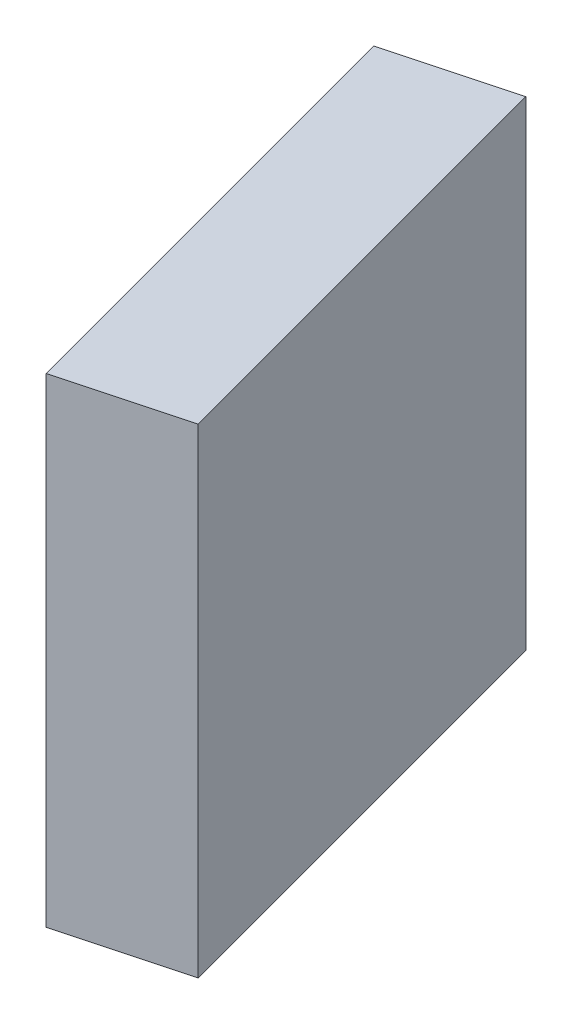
ISO-10303-21;
HEADER;
FILE_DESCRIPTION(('STEP AP214'),'2;1');
FILE_NAME('part.step','',(''),(''),'','','');
FILE_SCHEMA(('AUTOMOTIVE_DESIGN { 1 0 10303 214 1 1 1 1 }'));
ENDSEC;
DATA;
#1=APPLICATION_CONTEXT('core data for automotive mechanical design processes');
#2=APPLICATION_PROTOCOL_DEFINITION('international standard','automotive_design',2000,#1);
#3=PRODUCT_CONTEXT('',#1,'mechanical');
#4=PRODUCT('Part','Part','',(#3));
#5=PRODUCT_RELATED_PRODUCT_CATEGORY('part','',(#4));
#6=PRODUCT_DEFINITION_FORMATION('','',#4);
#7=PRODUCT_DEFINITION_CONTEXT('part definition',#1,'design');
#8=PRODUCT_DEFINITION('design','',#6,#7);
#9=PRODUCT_DEFINITION_SHAPE('','',#8);
#10=(LENGTH_UNIT() NAMED_UNIT(*) SI_UNIT(.MILLI.,.METRE.));
#11=(NAMED_UNIT(*) PLANE_ANGLE_UNIT() SI_UNIT($,.RADIAN.));
#12=(NAMED_UNIT(*) SI_UNIT($,.STERADIAN.) SOLID_ANGLE_UNIT());
#13=UNCERTAINTY_MEASURE_WITH_UNIT(LENGTH_MEASURE(1.E-05),#10,'distance_accuracy_value','');
#14=(GEOMETRIC_REPRESENTATION_CONTEXT(3) GLOBAL_UNCERTAINTY_ASSIGNED_CONTEXT((#13)) GLOBAL_UNIT_ASSIGNED_CONTEXT((#10,
#11,#12)) REPRESENTATION_CONTEXT('',''));
#15=CARTESIAN_POINT('',(0.,0.,0.));
#16=DIRECTION('',(0.,0.,1.));
#17=DIRECTION('',(1.,0.,0.));
#18=AXIS2_PLACEMENT_3D('',#15,#16,#17);
#19=CARTESIAN_POINT('',(-12.5000000000002,50.,-46.6506350946109));
#20=DIRECTION('',(0.258819045102525,0.,0.965925826289067));
#21=DIRECTION('',(0.965925826289067,0.,-0.258819045102525));
#22=AXIS2_PLACEMENT_3D('',#19,#20,#21);
#23=PLANE('',#22);
#24=DIRECTION('',(-0.965925826289067,0.,0.258819045102525));
#25=VECTOR('',#24,1.);
#26=CARTESIAN_POINT('',(-12.5000000000002,0.,-46.6506350946109));
#27=LINE('',#26,#25);
#28=CARTESIAN_POINT('',(0.,0.,-50.));
#29=VERTEX_POINT('',#28);
#30=CARTESIAN_POINT('',(-12.4999999999997,0.,-46.650635094611));
#31=VERTEX_POINT('',#30);
#32=EDGE_CURVE('E109',#29,#31,#27,.T.);
#33=ORIENTED_EDGE('',*,*,#32,.T.);
#34=DIRECTION('',(0.,-1.,0.));
#35=VECTOR('',#34,1.);
#36=CARTESIAN_POINT('',(-12.4999999999997,50.,-46.650635094611));
#37=LINE('',#36,#35);
#38=CARTESIAN_POINT('',(-12.4999999999997,50.,-46.650635094611));
#39=VERTEX_POINT('',#38);
#40=EDGE_CURVE('E11',#39,#31,#37,.T.);
#41=ORIENTED_EDGE('',*,*,#40,.F.);
#42=DIRECTION('',(-0.965925826289067,0.,0.258819045102525));
#43=VECTOR('',#42,1.);
#44=CARTESIAN_POINT('',(-12.5000000000002,50.,-46.6506350946109));
#45=LINE('',#44,#43);
#46=CARTESIAN_POINT('',(0.,50.,-50.));
#47=VERTEX_POINT('',#46);
#48=EDGE_CURVE('E91',#47,#39,#45,.T.);
#49=ORIENTED_EDGE('',*,*,#48,.F.);
#50=DIRECTION('',(0.,-1.,0.));
#51=VECTOR('',#50,1.);
#52=CARTESIAN_POINT('',(0.,50.,-50.));
#53=LINE('',#52,#51);
#54=EDGE_CURVE('E58',#47,#29,#53,.T.);
#55=ORIENTED_EDGE('',*,*,#54,.T.);
#56=EDGE_LOOP('',(#33,#41,#49,#55));
#57=FACE_BOUND('',#56,.T.);
#58=ADVANCED_FACE('F41',(#57),#23,.F.);
#59=CARTESIAN_POINT('',(0.,50.,0.));
#60=DIRECTION('',(0.96592582628907,0.,-0.258819045102515));
#61=DIRECTION('',(-0.258819045102515,0.,-0.96592582628907));
#62=AXIS2_PLACEMENT_3D('',#59,#60,#61);
#63=PLANE('',#62);
#64=DIRECTION('',(0.258819045102515,0.,0.96592582628907));
#65=VECTOR('',#64,1.);
#66=CARTESIAN_POINT('',(0.,0.,0.));
#67=LINE('',#66,#65);
#68=CARTESIAN_POINT('',(0.,0.,0.));
#69=VERTEX_POINT('',#68);
#70=EDGE_CURVE('E97',#31,#69,#67,.T.);
#71=ORIENTED_EDGE('',*,*,#70,.T.);
#72=DIRECTION('',(0.,-1.,0.));
#73=VECTOR('',#72,1.);
#74=CARTESIAN_POINT('',(0.,50.,0.));
#75=LINE('',#74,#73);
#76=CARTESIAN_POINT('',(0.,50.,0.));
#77=VERTEX_POINT('',#76);
#78=EDGE_CURVE('E50',#77,#69,#75,.T.);
#79=ORIENTED_EDGE('',*,*,#78,.F.);
#80=DIRECTION('',(0.258819045102515,0.,0.96592582628907));
#81=VECTOR('',#80,1.);
#82=CARTESIAN_POINT('',(0.,50.,0.));
#83=LINE('',#82,#81);
#84=EDGE_CURVE('E83',#39,#77,#83,.T.);
#85=ORIENTED_EDGE('',*,*,#84,.F.);
#86=ORIENTED_EDGE('',*,*,#40,.T.);
#87=EDGE_LOOP('',(#71,#79,#85,#86));
#88=FACE_BOUND('',#87,.T.);
#89=ADVANCED_FACE('F96',(#88),#63,.F.);
#90=CARTESIAN_POINT('',(0.,50.,0.));
#91=DIRECTION('',(0.258819045102525,0.,0.965925826289067));
#92=DIRECTION('',(0.965925826289067,0.,-0.258819045102525));
#93=AXIS2_PLACEMENT_3D('',#90,#91,#92);
#94=PLANE('',#93);
#95=DIRECTION('',(-0.965925826289067,0.,0.258819045102525));
#96=VECTOR('',#95,1.);
#97=CARTESIAN_POINT('',(0.,0.,0.));
#98=LINE('',#97,#96);
#99=CARTESIAN_POINT('',(12.4999999999997,0.,-3.34936490538901));
#100=VERTEX_POINT('',#99);
#101=EDGE_CURVE('E114',#100,#69,#98,.T.);
#102=ORIENTED_EDGE('',*,*,#101,.F.);
#103=DIRECTION('',(0.,-1.,0.));
#104=VECTOR('',#103,1.);
#105=CARTESIAN_POINT('',(12.4999999999997,50.,-3.34936490538901));
#106=LINE('',#105,#104);
#107=CARTESIAN_POINT('',(12.4999999999997,50.,-3.34936490538901));
#108=VERTEX_POINT('',#107);
#109=EDGE_CURVE('E72',#108,#100,#106,.T.);
#110=ORIENTED_EDGE('',*,*,#109,.F.);
#111=DIRECTION('',(-0.965925826289067,0.,0.258819045102525));
#112=VECTOR('',#111,1.);
#113=CARTESIAN_POINT('',(0.,50.,0.));
#114=LINE('',#113,#112);
#115=EDGE_CURVE('E90',#108,#77,#114,.T.);
#116=ORIENTED_EDGE('',*,*,#115,.T.);
#117=ORIENTED_EDGE('',*,*,#78,.T.);
#118=EDGE_LOOP('',(#102,#110,#116,#117));
#119=FACE_BOUND('',#118,.T.);
#120=ADVANCED_FACE('F101',(#119),#94,.T.);
#121=CARTESIAN_POINT('',(12.4999999999997,50.,-3.34936490538887));
#122=DIRECTION('',(0.96592582628907,0.,-0.258819045102515));
#123=DIRECTION('',(-0.258819045102515,0.,-0.96592582628907));
#124=AXIS2_PLACEMENT_3D('',#121,#122,#123);
#125=PLANE('',#124);
#126=DIRECTION('',(0.258819045102515,0.,0.96592582628907));
#127=VECTOR('',#126,1.);
#128=CARTESIAN_POINT('',(12.4999999999997,0.,-3.34936490538887));
#129=LINE('',#128,#127);
#130=EDGE_CURVE('E117',#29,#100,#129,.T.);
#131=ORIENTED_EDGE('',*,*,#130,.F.);
#132=ORIENTED_EDGE('',*,*,#54,.F.);
#133=DIRECTION('',(0.258819045102515,0.,0.96592582628907));
#134=VECTOR('',#133,1.);
#135=CARTESIAN_POINT('',(12.4999999999997,50.,-3.34936490538887));
#136=LINE('',#135,#134);
#137=EDGE_CURVE('E103',#47,#108,#136,.T.);
#138=ORIENTED_EDGE('',*,*,#137,.T.);
#139=ORIENTED_EDGE('',*,*,#109,.T.);
#140=EDGE_LOOP('',(#131,#132,#138,#139));
#141=FACE_BOUND('',#140,.T.);
#142=ADVANCED_FACE('F127',(#141),#125,.T.);
#143=CARTESIAN_POINT('',(0.,50.,0.));
#144=DIRECTION('',(0.,1.,0.));
#145=DIRECTION('',(0.,0.,1.));
#146=AXIS2_PLACEMENT_3D('',#143,#144,#145);
#147=PLANE('',#146);
#148=ORIENTED_EDGE('',*,*,#48,.T.);
#149=ORIENTED_EDGE('',*,*,#84,.T.);
#150=ORIENTED_EDGE('',*,*,#115,.F.);
#151=ORIENTED_EDGE('',*,*,#137,.F.);
#152=EDGE_LOOP('',(#148,#149,#150,#151));
#153=FACE_BOUND('',#152,.T.);
#154=ADVANCED_FACE('F87',(#153),#147,.T.);
#155=CARTESIAN_POINT('',(0.,0.,0.));
#156=DIRECTION('',(0.,1.,0.));
#157=DIRECTION('',(0.,0.,1.));
#158=AXIS2_PLACEMENT_3D('',#155,#156,#157);
#159=PLANE('',#158);
#160=ORIENTED_EDGE('',*,*,#32,.F.);
#161=ORIENTED_EDGE('',*,*,#130,.T.);
#162=ORIENTED_EDGE('',*,*,#101,.T.);
#163=ORIENTED_EDGE('',*,*,#70,.F.);
#164=EDGE_LOOP('',(#160,#161,#162,#163));
#165=FACE_BOUND('',#164,.T.);
#166=ADVANCED_FACE('F126',(#165),#159,.F.);
#167=CLOSED_SHELL('',(#58,#89,#120,#142,#154,#166));
#168=MANIFOLD_SOLID_BREP('B2',#167);
#169=ADVANCED_BREP_SHAPE_REPRESENTATION('',(#18,#168),#14);
#170=SHAPE_DEFINITION_REPRESENTATION(#9,#169);
ENDSEC;
END-ISO-10303-21;
